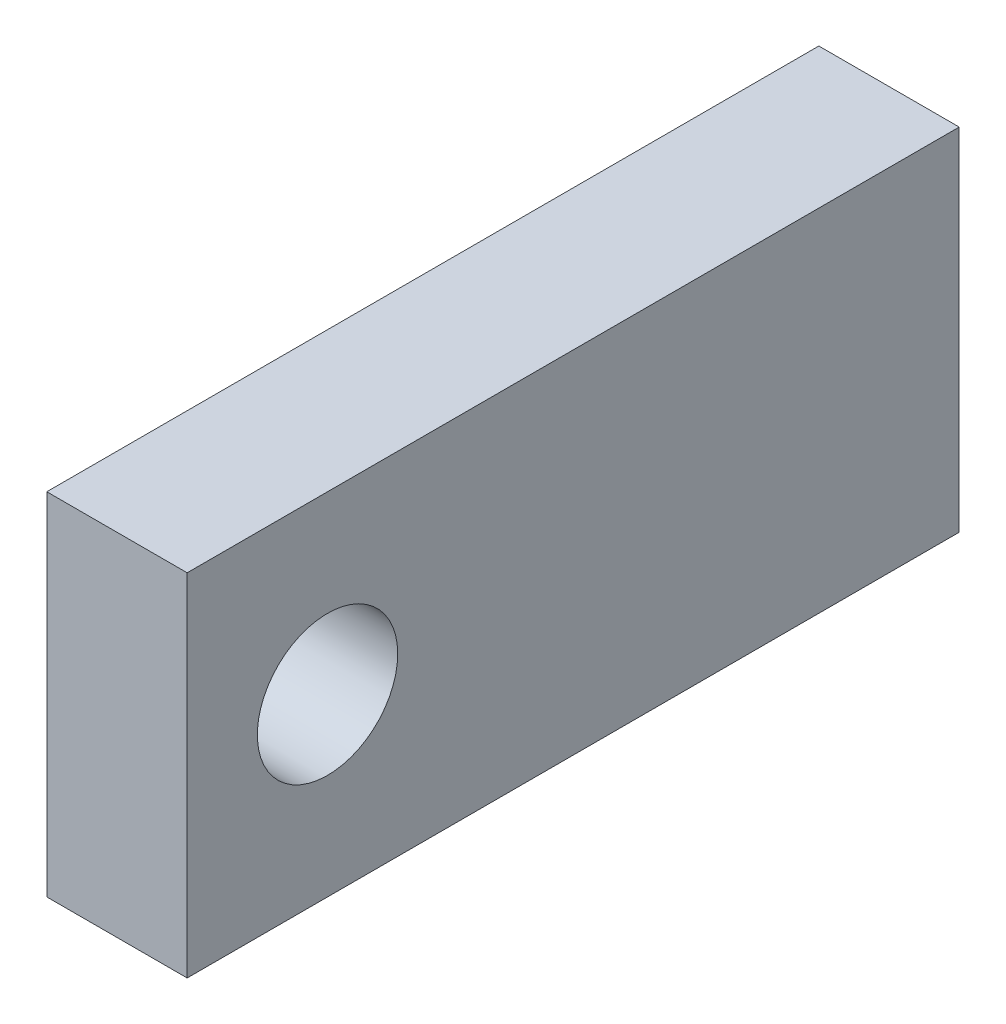
ISO-10303-21;
HEADER;
FILE_DESCRIPTION(('STEP AP214'),'2;1');
FILE_NAME('part.step','',(''),(''),'','','');
FILE_SCHEMA(('AUTOMOTIVE_DESIGN { 1 0 10303 214 1 1 1 1 }'));
ENDSEC;
DATA;
#1=APPLICATION_CONTEXT('core data for automotive mechanical design processes');
#2=APPLICATION_PROTOCOL_DEFINITION('international standard','automotive_design',2000,#1);
#3=PRODUCT_CONTEXT('',#1,'mechanical');
#4=PRODUCT('Part','Part','',(#3));
#5=PRODUCT_RELATED_PRODUCT_CATEGORY('part','',(#4));
#6=PRODUCT_DEFINITION_FORMATION('','',#4);
#7=PRODUCT_DEFINITION_CONTEXT('part definition',#1,'design');
#8=PRODUCT_DEFINITION('design','',#6,#7);
#9=PRODUCT_DEFINITION_SHAPE('','',#8);
#10=(LENGTH_UNIT() NAMED_UNIT(*) SI_UNIT(.MILLI.,.METRE.));
#11=(NAMED_UNIT(*) PLANE_ANGLE_UNIT() SI_UNIT($,.RADIAN.));
#12=(NAMED_UNIT(*) SI_UNIT($,.STERADIAN.) SOLID_ANGLE_UNIT());
#13=UNCERTAINTY_MEASURE_WITH_UNIT(LENGTH_MEASURE(1.E-05),#10,'distance_accuracy_value','');
#14=(GEOMETRIC_REPRESENTATION_CONTEXT(3) GLOBAL_UNCERTAINTY_ASSIGNED_CONTEXT((#13)) GLOBAL_UNIT_ASSIGNED_CONTEXT((#10,
#11,#12)) REPRESENTATION_CONTEXT('',''));
#15=CARTESIAN_POINT('',(0.,0.,0.));
#16=DIRECTION('',(0.,0.,1.));
#17=DIRECTION('',(1.,0.,0.));
#18=AXIS2_PLACEMENT_3D('',#15,#16,#17);
#19=CARTESIAN_POINT('',(0.,0.,69.85));
#20=DIRECTION('',(0.,0.,-1.));
#21=DIRECTION('',(-1.,0.,0.));
#22=AXIS2_PLACEMENT_3D('',#19,#20,#21);
#23=PLANE('',#22);
#24=DIRECTION('',(0.,1.,0.));
#25=VECTOR('',#24,1.);
#26=CARTESIAN_POINT('',(6.35,-15.875,69.85));
#27=LINE('',#26,#25);
#28=CARTESIAN_POINT('',(6.35,-15.875,69.85));
#29=VERTEX_POINT('',#28);
#30=CARTESIAN_POINT('',(6.35,15.875,69.85));
#31=VERTEX_POINT('',#30);
#32=EDGE_CURVE('E94',#29,#31,#27,.T.);
#33=ORIENTED_EDGE('',*,*,#32,.T.);
#34=DIRECTION('',(-1.,0.,0.));
#35=VECTOR('',#34,1.);
#36=CARTESIAN_POINT('',(-6.35,15.875,69.85));
#37=LINE('',#36,#35);
#38=CARTESIAN_POINT('',(-6.35,15.875,69.85));
#39=VERTEX_POINT('',#38);
#40=EDGE_CURVE('E90',#31,#39,#37,.T.);
#41=ORIENTED_EDGE('',*,*,#40,.T.);
#42=DIRECTION('',(0.,-1.,0.));
#43=VECTOR('',#42,1.);
#44=CARTESIAN_POINT('',(-6.35,-15.875,69.85));
#45=LINE('',#44,#43);
#46=CARTESIAN_POINT('',(-6.35,-15.875,69.85));
#47=VERTEX_POINT('',#46);
#48=EDGE_CURVE('E92',#39,#47,#45,.T.);
#49=ORIENTED_EDGE('',*,*,#48,.T.);
#50=DIRECTION('',(1.,0.,0.));
#51=VECTOR('',#50,1.);
#52=CARTESIAN_POINT('',(-6.35,-15.875,69.85));
#53=LINE('',#52,#51);
#54=EDGE_CURVE('E59',#47,#29,#53,.T.);
#55=ORIENTED_EDGE('',*,*,#54,.T.);
#56=EDGE_LOOP('',(#33,#41,#49,#55));
#57=FACE_BOUND('',#56,.T.);
#58=ADVANCED_FACE('F41',(#57),#23,.F.);
#59=CARTESIAN_POINT('',(0.,0.,0.));
#60=DIRECTION('',(0.,0.,-1.));
#61=DIRECTION('',(-1.,0.,0.));
#62=AXIS2_PLACEMENT_3D('',#59,#60,#61);
#63=PLANE('',#62);
#64=CARTESIAN_POINT('',(0.,9.525,0.));
#65=DIRECTION('',(0.,0.,1.));
#66=DIRECTION('',(1.,0.,0.));
#67=AXIS2_PLACEMENT_3D('',#64,#65,#66);
#68=CIRCLE('',#67,3.175);
#69=CARTESIAN_POINT('',(3.175,9.525,0.));
#70=VERTEX_POINT('',#69);
#71=EDGE_CURVE('E117',#70,#70,#68,.T.);
#72=ORIENTED_EDGE('',*,*,#71,.T.);
#73=EDGE_LOOP('',(#72));
#74=FACE_BOUND('',#73,.T.);
#75=DIRECTION('',(0.,1.,0.));
#76=VECTOR('',#75,1.);
#77=CARTESIAN_POINT('',(6.35,-15.875,0.));
#78=LINE('',#77,#76);
#79=CARTESIAN_POINT('',(6.35,-15.875,0.));
#80=VERTEX_POINT('',#79);
#81=CARTESIAN_POINT('',(6.35,15.875,0.));
#82=VERTEX_POINT('',#81);
#83=EDGE_CURVE('E113',#80,#82,#78,.T.);
#84=ORIENTED_EDGE('',*,*,#83,.F.);
#85=DIRECTION('',(1.,0.,0.));
#86=VECTOR('',#85,1.);
#87=CARTESIAN_POINT('',(-6.35,-15.875,0.));
#88=LINE('',#87,#86);
#89=CARTESIAN_POINT('',(-6.35,-15.875,0.));
#90=VERTEX_POINT('',#89);
#91=EDGE_CURVE('E82',#90,#80,#88,.T.);
#92=ORIENTED_EDGE('',*,*,#91,.F.);
#93=DIRECTION('',(0.,-1.,0.));
#94=VECTOR('',#93,1.);
#95=CARTESIAN_POINT('',(-6.35,-15.875,0.));
#96=LINE('',#95,#94);
#97=CARTESIAN_POINT('',(-6.35,15.875,0.));
#98=VERTEX_POINT('',#97);
#99=EDGE_CURVE('E76',#98,#90,#96,.T.);
#100=ORIENTED_EDGE('',*,*,#99,.F.);
#101=DIRECTION('',(-1.,0.,0.));
#102=VECTOR('',#101,1.);
#103=CARTESIAN_POINT('',(-6.35,15.875,0.));
#104=LINE('',#103,#102);
#105=EDGE_CURVE('E100',#82,#98,#104,.T.);
#106=ORIENTED_EDGE('',*,*,#105,.F.);
#107=EDGE_LOOP('',(#84,#92,#100,#106));
#108=FACE_BOUND('',#107,.T.);
#109=CARTESIAN_POINT('',(0.,-9.525,0.));
#110=DIRECTION('',(0.,0.,1.));
#111=DIRECTION('',(1.,0.,0.));
#112=AXIS2_PLACEMENT_3D('',#109,#110,#111);
#113=CIRCLE('',#112,3.175);
#114=CARTESIAN_POINT('',(3.175,-9.525,0.));
#115=VERTEX_POINT('',#114);
#116=EDGE_CURVE('E142',#115,#115,#113,.T.);
#117=ORIENTED_EDGE('',*,*,#116,.T.);
#118=EDGE_LOOP('',(#117));
#119=FACE_BOUND('',#118,.T.);
#120=ADVANCED_FACE('F164',(#74,#108,#119),#63,.T.);
#121=CARTESIAN_POINT('',(6.35,-15.875,69.85));
#122=DIRECTION('',(-1.,0.,0.));
#123=DIRECTION('',(0.,0.,1.));
#124=AXIS2_PLACEMENT_3D('',#121,#122,#123);
#125=PLANE('',#124);
#126=CARTESIAN_POINT('',(6.35,0.,57.15));
#127=DIRECTION('',(1.,0.,0.));
#128=DIRECTION('',(0.,0.,-1.));
#129=AXIS2_PLACEMENT_3D('',#126,#127,#128);
#130=CIRCLE('',#129,6.35);
#131=CARTESIAN_POINT('',(6.35,0.,50.8));
#132=VERTEX_POINT('',#131);
#133=EDGE_CURVE('E152',#132,#132,#130,.T.);
#134=ORIENTED_EDGE('',*,*,#133,.F.);
#135=EDGE_LOOP('',(#134));
#136=FACE_BOUND('',#135,.T.);
#137=ORIENTED_EDGE('',*,*,#83,.T.);
#138=DIRECTION('',(0.,0.,-1.));
#139=VECTOR('',#138,1.);
#140=CARTESIAN_POINT('',(6.35,15.875,69.85));
#141=LINE('',#140,#139);
#142=EDGE_CURVE('E102',#31,#82,#141,.T.);
#143=ORIENTED_EDGE('',*,*,#142,.F.);
#144=ORIENTED_EDGE('',*,*,#32,.F.);
#145=DIRECTION('',(0.,0.,-1.));
#146=VECTOR('',#145,1.);
#147=CARTESIAN_POINT('',(6.35,-15.875,69.85));
#148=LINE('',#147,#146);
#149=EDGE_CURVE('E109',#29,#80,#148,.T.);
#150=ORIENTED_EDGE('',*,*,#149,.T.);
#151=EDGE_LOOP('',(#137,#143,#144,#150));
#152=FACE_BOUND('',#151,.T.);
#153=ADVANCED_FACE('F43',(#136,#152),#125,.F.);
#154=CARTESIAN_POINT('',(-6.35,15.875,69.85));
#155=DIRECTION('',(0.,-1.,0.));
#156=DIRECTION('',(0.,0.,-1.));
#157=AXIS2_PLACEMENT_3D('',#154,#155,#156);
#158=PLANE('',#157);
#159=ORIENTED_EDGE('',*,*,#105,.T.);
#160=DIRECTION('',(0.,0.,-1.));
#161=VECTOR('',#160,1.);
#162=CARTESIAN_POINT('',(-6.35,15.875,69.85));
#163=LINE('',#162,#161);
#164=EDGE_CURVE('E98',#39,#98,#163,.T.);
#165=ORIENTED_EDGE('',*,*,#164,.F.);
#166=ORIENTED_EDGE('',*,*,#40,.F.);
#167=ORIENTED_EDGE('',*,*,#142,.T.);
#168=EDGE_LOOP('',(#159,#165,#166,#167));
#169=FACE_BOUND('',#168,.T.);
#170=ADVANCED_FACE('F99',(#169),#158,.F.);
#171=CARTESIAN_POINT('',(-6.35,-15.875,69.85));
#172=DIRECTION('',(1.,0.,0.));
#173=DIRECTION('',(0.,0.,-1.));
#174=AXIS2_PLACEMENT_3D('',#171,#172,#173);
#175=PLANE('',#174);
#176=CARTESIAN_POINT('',(-6.35,0.,57.15));
#177=DIRECTION('',(1.,0.,0.));
#178=DIRECTION('',(0.,0.,-1.));
#179=AXIS2_PLACEMENT_3D('',#176,#177,#178);
#180=CIRCLE('',#179,6.35);
#181=CARTESIAN_POINT('',(-6.35,0.,50.8));
#182=VERTEX_POINT('',#181);
#183=EDGE_CURVE('E145',#182,#182,#180,.T.);
#184=ORIENTED_EDGE('',*,*,#183,.T.);
#185=EDGE_LOOP('',(#184));
#186=FACE_BOUND('',#185,.T.);
#187=ORIENTED_EDGE('',*,*,#99,.T.);
#188=DIRECTION('',(0.,0.,-1.));
#189=VECTOR('',#188,1.);
#190=CARTESIAN_POINT('',(-6.35,-15.875,69.85));
#191=LINE('',#190,#189);
#192=EDGE_CURVE('E103',#47,#90,#191,.T.);
#193=ORIENTED_EDGE('',*,*,#192,.F.);
#194=ORIENTED_EDGE('',*,*,#48,.F.);
#195=ORIENTED_EDGE('',*,*,#164,.T.);
#196=EDGE_LOOP('',(#187,#193,#194,#195));
#197=FACE_BOUND('',#196,.T.);
#198=ADVANCED_FACE('F105',(#186,#197),#175,.F.);
#199=CARTESIAN_POINT('',(-6.35,-15.875,69.85));
#200=DIRECTION('',(0.,1.,0.));
#201=DIRECTION('',(0.,0.,1.));
#202=AXIS2_PLACEMENT_3D('',#199,#200,#201);
#203=PLANE('',#202);
#204=ORIENTED_EDGE('',*,*,#91,.T.);
#205=ORIENTED_EDGE('',*,*,#149,.F.);
#206=ORIENTED_EDGE('',*,*,#54,.F.);
#207=ORIENTED_EDGE('',*,*,#192,.T.);
#208=EDGE_LOOP('',(#204,#205,#206,#207));
#209=FACE_BOUND('',#208,.T.);
#210=ADVANCED_FACE('F176',(#209),#203,.F.);
#211=CARTESIAN_POINT('',(0.,9.525,69.85));
#212=DIRECTION('',(0.,0.,-1.));
#213=DIRECTION('',(-1.,0.,0.));
#214=AXIS2_PLACEMENT_3D('',#211,#212,#213);
#215=CYLINDRICAL_SURFACE('',#214,3.175);
#216=CARTESIAN_POINT('',(0.,9.525,19.05));
#217=DIRECTION('',(0.,0.,-1.));
#218=DIRECTION('',(-1.,0.,0.));
#219=AXIS2_PLACEMENT_3D('',#216,#217,#218);
#220=CIRCLE('',#219,3.175);
#221=CARTESIAN_POINT('',(-3.175,9.525,19.05));
#222=VERTEX_POINT('',#221);
#223=EDGE_CURVE('E12',#222,#222,#220,.T.);
#224=ORIENTED_EDGE('',*,*,#223,.F.);
#225=EDGE_LOOP('',(#224));
#226=FACE_BOUND('',#225,.T.);
#227=ORIENTED_EDGE('',*,*,#71,.F.);
#228=EDGE_LOOP('',(#227));
#229=FACE_BOUND('',#228,.T.);
#230=ADVANCED_FACE('F138',(#226,#229),#215,.F.);
#231=CARTESIAN_POINT('',(0.,-9.525,69.85));
#232=DIRECTION('',(0.,0.,-1.));
#233=DIRECTION('',(-1.,0.,0.));
#234=AXIS2_PLACEMENT_3D('',#231,#232,#233);
#235=CYLINDRICAL_SURFACE('',#234,3.175);
#236=CARTESIAN_POINT('',(0.,-9.525,19.05));
#237=DIRECTION('',(0.,0.,-1.));
#238=DIRECTION('',(-1.,0.,0.));
#239=AXIS2_PLACEMENT_3D('',#236,#237,#238);
#240=CIRCLE('',#239,3.175);
#241=CARTESIAN_POINT('',(-3.175,-9.525,19.05));
#242=VERTEX_POINT('',#241);
#243=EDGE_CURVE('E51',#242,#242,#240,.T.);
#244=ORIENTED_EDGE('',*,*,#243,.F.);
#245=EDGE_LOOP('',(#244));
#246=FACE_BOUND('',#245,.T.);
#247=ORIENTED_EDGE('',*,*,#116,.F.);
#248=EDGE_LOOP('',(#247));
#249=FACE_BOUND('',#248,.T.);
#250=ADVANCED_FACE('F135',(#246,#249),#235,.F.);
#251=CARTESIAN_POINT('',(0.,0.,19.05));
#252=DIRECTION('',(0.,0.,-1.));
#253=DIRECTION('',(-1.,0.,0.));
#254=AXIS2_PLACEMENT_3D('',#251,#252,#253);
#255=PLANE('',#254);
#256=ORIENTED_EDGE('',*,*,#243,.T.);
#257=EDGE_LOOP('',(#256));
#258=FACE_BOUND('',#257,.T.);
#259=ADVANCED_FACE('F133',(#258),#255,.T.);
#260=CARTESIAN_POINT('',(0.,0.,19.05));
#261=DIRECTION('',(0.,0.,-1.));
#262=DIRECTION('',(-1.,0.,0.));
#263=AXIS2_PLACEMENT_3D('',#260,#261,#262);
#264=PLANE('',#263);
#265=ORIENTED_EDGE('',*,*,#223,.T.);
#266=EDGE_LOOP('',(#265));
#267=FACE_BOUND('',#266,.T.);
#268=ADVANCED_FACE('F212',(#267),#264,.T.);
#269=CARTESIAN_POINT('',(-6.35,0.,57.15));
#270=DIRECTION('',(1.,0.,0.));
#271=DIRECTION('',(0.,0.,-1.));
#272=AXIS2_PLACEMENT_3D('',#269,#270,#271);
#273=CYLINDRICAL_SURFACE('',#272,6.35);
#274=ORIENTED_EDGE('',*,*,#183,.F.);
#275=EDGE_LOOP('',(#274));
#276=FACE_BOUND('',#275,.T.);
#277=ORIENTED_EDGE('',*,*,#133,.T.);
#278=EDGE_LOOP('',(#277));
#279=FACE_BOUND('',#278,.T.);
#280=ADVANCED_FACE('F160',(#276,#279),#273,.F.);
#281=CLOSED_SHELL('',(#58,#120,#153,#170,#198,#210,#230,#250,#259,#268,#280));
#282=MANIFOLD_SOLID_BREP('B2',#281);
#283=ADVANCED_BREP_SHAPE_REPRESENTATION('',(#18,#282),#14);
#284=SHAPE_DEFINITION_REPRESENTATION(#9,#283);
ENDSEC;
END-ISO-10303-21;
